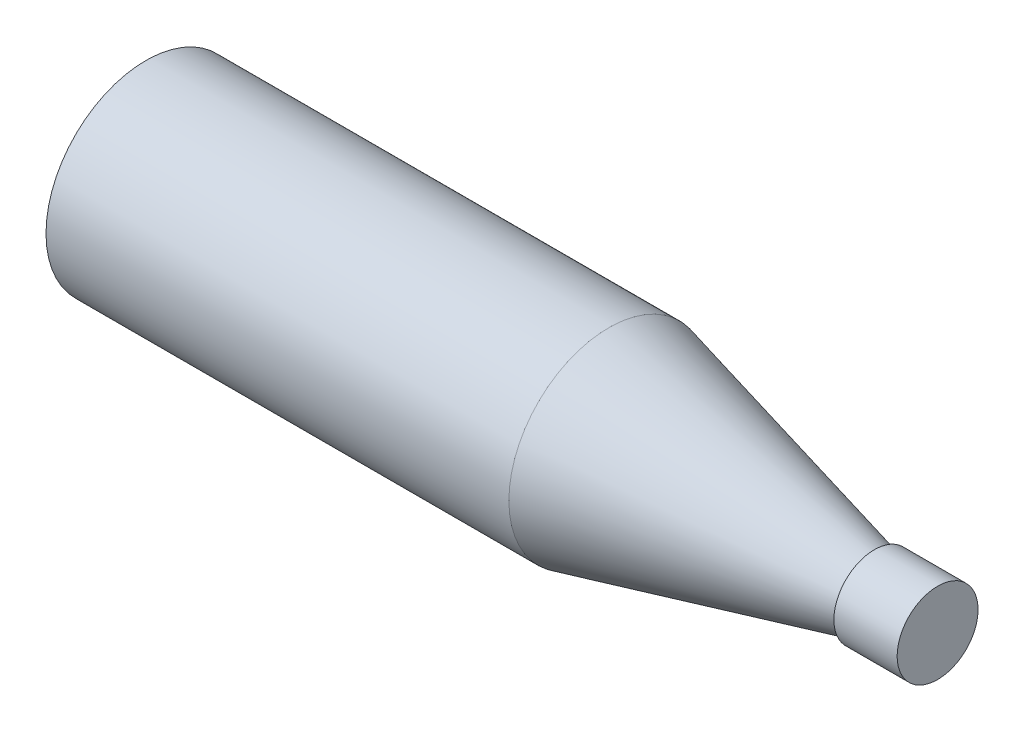
ISO-10303-21;
HEADER;
FILE_DESCRIPTION(('STEP AP214'),'2;1');
FILE_NAME('part.step','',(''),(''),'','','');
FILE_SCHEMA(('AUTOMOTIVE_DESIGN { 1 0 10303 214 1 1 1 1 }'));
ENDSEC;
DATA;
#1=APPLICATION_CONTEXT('core data for automotive mechanical design processes');
#2=APPLICATION_PROTOCOL_DEFINITION('international standard','automotive_design',2000,#1);
#3=PRODUCT_CONTEXT('',#1,'mechanical');
#4=PRODUCT('Part','Part','',(#3));
#5=PRODUCT_RELATED_PRODUCT_CATEGORY('part','',(#4));
#6=PRODUCT_DEFINITION_FORMATION('','',#4);
#7=PRODUCT_DEFINITION_CONTEXT('part definition',#1,'design');
#8=PRODUCT_DEFINITION('design','',#6,#7);
#9=PRODUCT_DEFINITION_SHAPE('','',#8);
#10=(LENGTH_UNIT() NAMED_UNIT(*) SI_UNIT(.MILLI.,.METRE.));
#11=(NAMED_UNIT(*) PLANE_ANGLE_UNIT() SI_UNIT($,.RADIAN.));
#12=(NAMED_UNIT(*) SI_UNIT($,.STERADIAN.) SOLID_ANGLE_UNIT());
#13=UNCERTAINTY_MEASURE_WITH_UNIT(LENGTH_MEASURE(1.E-05),#10,'distance_accuracy_value','');
#14=(GEOMETRIC_REPRESENTATION_CONTEXT(3) GLOBAL_UNCERTAINTY_ASSIGNED_CONTEXT((#13)) GLOBAL_UNIT_ASSIGNED_CONTEXT((#10,
#11,#12)) REPRESENTATION_CONTEXT('',''));
#15=CARTESIAN_POINT('',(0.,0.,0.));
#16=DIRECTION('',(0.,0.,1.));
#17=DIRECTION('',(1.,0.,0.));
#18=AXIS2_PLACEMENT_3D('',#15,#16,#17);
#19=CARTESIAN_POINT('',(-50.7749378945587,0.,0.));
#20=DIRECTION('',(1.,0.,0.));
#21=DIRECTION('',(0.,0.,-1.));
#22=AXIS2_PLACEMENT_3D('',#19,#20,#21);
#23=PLANE('',#22);
#24=CARTESIAN_POINT('',(-50.7749378945587,0.,0.));
#25=DIRECTION('',(-1.,0.,0.));
#26=DIRECTION('',(0.,0.,1.));
#27=AXIS2_PLACEMENT_3D('',#24,#25,#26);
#28=CIRCLE('',#27,39.5);
#29=CARTESIAN_POINT('',(-50.7749378945587,0.,39.5));
#30=VERTEX_POINT('',#29);
#31=EDGE_CURVE('E10',#30,#30,#28,.T.);
#32=ORIENTED_EDGE('',*,*,#31,.T.);
#33=EDGE_LOOP('',(#32));
#34=FACE_BOUND('',#33,.T.);
#35=ADVANCED_FACE('F31',(#34),#23,.F.);
#36=CARTESIAN_POINT('',(-50.7749378945587,0.,0.));
#37=DIRECTION('',(-1.,0.,0.));
#38=DIRECTION('',(0.,0.,1.));
#39=AXIS2_PLACEMENT_3D('',#36,#37,#38);
#40=CYLINDRICAL_SURFACE('',#39,39.5);
#41=ORIENTED_EDGE('',*,*,#31,.F.);
#42=EDGE_LOOP('',(#41));
#43=FACE_BOUND('',#42,.T.);
#44=CARTESIAN_POINT('',(132.225062105441,0.,0.));
#45=DIRECTION('',(-1.,0.,0.));
#46=DIRECTION('',(0.,0.,1.));
#47=AXIS2_PLACEMENT_3D('',#44,#45,#46);
#48=CIRCLE('',#47,39.5);
#49=CARTESIAN_POINT('',(132.225062105441,0.,39.5));
#50=VERTEX_POINT('',#49);
#51=EDGE_CURVE('E37',#50,#50,#48,.T.);
#52=ORIENTED_EDGE('',*,*,#51,.T.);
#53=EDGE_LOOP('',(#52));
#54=FACE_BOUND('',#53,.T.);
#55=ADVANCED_FACE('F66',(#43,#54),#40,.T.);
#56=CARTESIAN_POINT('',(237.225062105441,0.,0.));
#57=DIRECTION('',(-1.,0.,0.));
#58=DIRECTION('',(0.,0.,1.));
#59=AXIS2_PLACEMENT_3D('',#56,#57,#58);
#60=CONICAL_SURFACE('',#59,13.5,0.24273651441777);
#61=ORIENTED_EDGE('',*,*,#51,.F.);
#62=EDGE_LOOP('',(#61));
#63=FACE_BOUND('',#62,.T.);
#64=CARTESIAN_POINT('',(237.225062105441,0.,0.));
#65=DIRECTION('',(-1.,0.,0.));
#66=DIRECTION('',(0.,0.,1.));
#67=AXIS2_PLACEMENT_3D('',#64,#65,#66);
#68=CIRCLE('',#67,13.5);
#69=CARTESIAN_POINT('',(237.225062105441,0.,13.5));
#70=VERTEX_POINT('',#69);
#71=EDGE_CURVE('E41',#70,#70,#68,.T.);
#72=ORIENTED_EDGE('',*,*,#71,.T.);
#73=EDGE_LOOP('',(#72));
#74=FACE_BOUND('',#73,.T.);
#75=ADVANCED_FACE('F70',(#63,#74),#60,.T.);
#76=CARTESIAN_POINT('',(237.225062105441,13.5,0.));
#77=DIRECTION('',(1.,0.,0.));
#78=DIRECTION('',(0.,0.,-1.));
#79=AXIS2_PLACEMENT_3D('',#76,#77,#78);
#80=PLANE('',#79);
#81=ORIENTED_EDGE('',*,*,#71,.F.);
#82=EDGE_LOOP('',(#81));
#83=FACE_BOUND('',#82,.T.);
#84=CARTESIAN_POINT('',(237.225062105441,0.,0.));
#85=DIRECTION('',(-1.,0.,0.));
#86=DIRECTION('',(0.,0.,1.));
#87=AXIS2_PLACEMENT_3D('',#84,#85,#86);
#88=CIRCLE('',#87,16.);
#89=CARTESIAN_POINT('',(237.225062105441,0.,16.));
#90=VERTEX_POINT('',#89);
#91=EDGE_CURVE('E45',#90,#90,#88,.T.);
#92=ORIENTED_EDGE('',*,*,#91,.T.);
#93=EDGE_LOOP('',(#92));
#94=FACE_BOUND('',#93,.T.);
#95=ADVANCED_FACE('F62',(#83,#94),#80,.F.);
#96=CARTESIAN_POINT('',(-50.7749378945587,0.,0.));
#97=DIRECTION('',(-1.,0.,0.));
#98=DIRECTION('',(0.,0.,1.));
#99=AXIS2_PLACEMENT_3D('',#96,#97,#98);
#100=CYLINDRICAL_SURFACE('',#99,16.);
#101=ORIENTED_EDGE('',*,*,#91,.F.);
#102=EDGE_LOOP('',(#101));
#103=FACE_BOUND('',#102,.T.);
#104=CARTESIAN_POINT('',(262.225062105441,0.,0.));
#105=DIRECTION('',(-1.,0.,0.));
#106=DIRECTION('',(0.,0.,1.));
#107=AXIS2_PLACEMENT_3D('',#104,#105,#106);
#108=CIRCLE('',#107,16.);
#109=CARTESIAN_POINT('',(262.225062105441,0.,16.));
#110=VERTEX_POINT('',#109);
#111=EDGE_CURVE('E50',#110,#110,#108,.T.);
#112=ORIENTED_EDGE('',*,*,#111,.T.);
#113=EDGE_LOOP('',(#112));
#114=FACE_BOUND('',#113,.T.);
#115=ADVANCED_FACE('F54',(#103,#114),#100,.T.);
#116=CARTESIAN_POINT('',(262.225062105441,16.,0.));
#117=DIRECTION('',(-1.,0.,0.));
#118=DIRECTION('',(0.,0.,1.));
#119=AXIS2_PLACEMENT_3D('',#116,#117,#118);
#120=PLANE('',#119);
#121=ORIENTED_EDGE('',*,*,#111,.F.);
#122=EDGE_LOOP('',(#121));
#123=FACE_BOUND('',#122,.T.);
#124=ADVANCED_FACE('F56',(#123),#120,.F.);
#125=CLOSED_SHELL('',(#35,#55,#75,#95,#115,#124));
#126=MANIFOLD_SOLID_BREP('B2',#125);
#127=ADVANCED_BREP_SHAPE_REPRESENTATION('',(#18,#126),#14);
#128=SHAPE_DEFINITION_REPRESENTATION(#9,#127);
ENDSEC;
END-ISO-10303-21;
